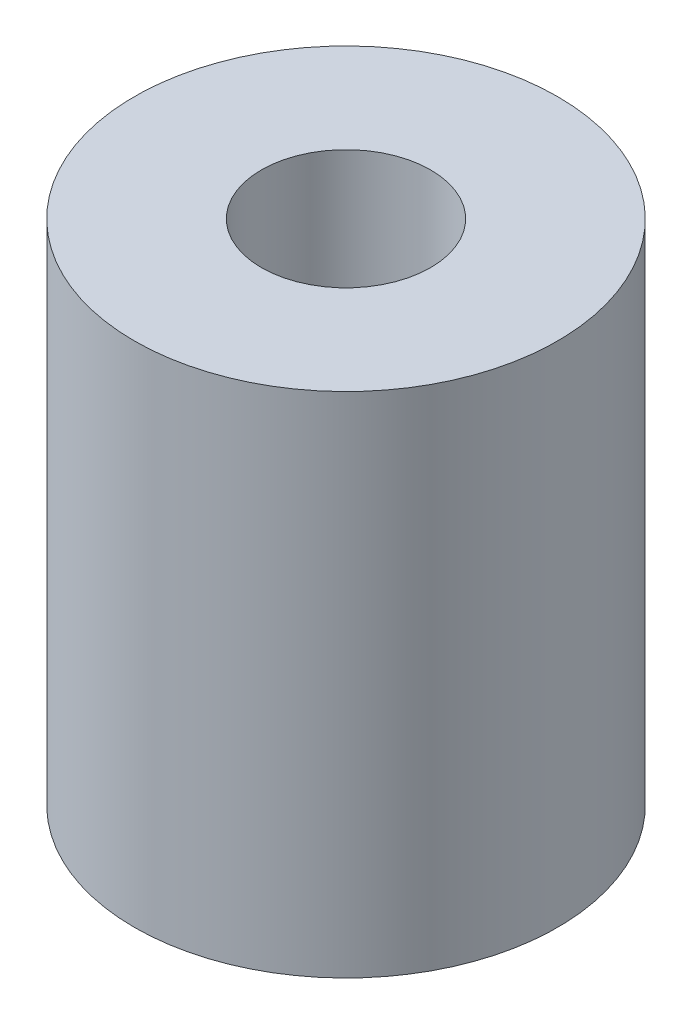
ISO-10303-21;
HEADER;
FILE_DESCRIPTION(('STEP AP214'),'2;1');
FILE_NAME('part.step','',(''),(''),'','','');
FILE_SCHEMA(('AUTOMOTIVE_DESIGN { 1 0 10303 214 1 1 1 1 }'));
ENDSEC;
DATA;
#1=APPLICATION_CONTEXT('core data for automotive mechanical design processes');
#2=APPLICATION_PROTOCOL_DEFINITION('international standard','automotive_design',2000,#1);
#3=PRODUCT_CONTEXT('',#1,'mechanical');
#4=PRODUCT('Part','Part','',(#3));
#5=PRODUCT_RELATED_PRODUCT_CATEGORY('part','',(#4));
#6=PRODUCT_DEFINITION_FORMATION('','',#4);
#7=PRODUCT_DEFINITION_CONTEXT('part definition',#1,'design');
#8=PRODUCT_DEFINITION('design','',#6,#7);
#9=PRODUCT_DEFINITION_SHAPE('','',#8);
#10=(LENGTH_UNIT() NAMED_UNIT(*) SI_UNIT(.MILLI.,.METRE.));
#11=(NAMED_UNIT(*) PLANE_ANGLE_UNIT() SI_UNIT($,.RADIAN.));
#12=(NAMED_UNIT(*) SI_UNIT($,.STERADIAN.) SOLID_ANGLE_UNIT());
#13=UNCERTAINTY_MEASURE_WITH_UNIT(LENGTH_MEASURE(1.E-05),#10,'distance_accuracy_value','');
#14=(GEOMETRIC_REPRESENTATION_CONTEXT(3) GLOBAL_UNCERTAINTY_ASSIGNED_CONTEXT((#13)) GLOBAL_UNIT_ASSIGNED_CONTEXT((#10,
#11,#12)) REPRESENTATION_CONTEXT('',''));
#15=CARTESIAN_POINT('',(0.,0.,0.));
#16=DIRECTION('',(0.,0.,1.));
#17=DIRECTION('',(1.,0.,0.));
#18=AXIS2_PLACEMENT_3D('',#15,#16,#17);
#19=CARTESIAN_POINT('',(0.,6.,0.));
#20=DIRECTION('',(0.,1.,0.));
#21=DIRECTION('',(0.,0.,1.));
#22=AXIS2_PLACEMENT_3D('',#19,#20,#21);
#23=PLANE('',#22);
#24=CARTESIAN_POINT('',(0.,6.,0.));
#25=DIRECTION('',(0.,1.,0.));
#26=DIRECTION('',(0.,0.,1.));
#27=AXIS2_PLACEMENT_3D('',#24,#25,#26);
#28=CIRCLE('',#27,2.5);
#29=CARTESIAN_POINT('',(0.,6.,2.5));
#30=VERTEX_POINT('',#29);
#31=EDGE_CURVE('E10',#30,#30,#28,.T.);
#32=ORIENTED_EDGE('',*,*,#31,.T.);
#33=EDGE_LOOP('',(#32));
#34=FACE_BOUND('',#33,.T.);
#35=CARTESIAN_POINT('',(0.,6.,0.));
#36=DIRECTION('',(0.,1.,0.));
#37=DIRECTION('',(0.,0.,1.));
#38=AXIS2_PLACEMENT_3D('',#35,#36,#37);
#39=CIRCLE('',#38,1.);
#40=CARTESIAN_POINT('',(0.,6.,1.));
#41=VERTEX_POINT('',#40);
#42=EDGE_CURVE('E54',#41,#41,#39,.T.);
#43=ORIENTED_EDGE('',*,*,#42,.F.);
#44=EDGE_LOOP('',(#43));
#45=FACE_BOUND('',#44,.T.);
#46=ADVANCED_FACE('F41',(#34,#45),#23,.T.);
#47=CARTESIAN_POINT('',(0.,0.,0.));
#48=DIRECTION('',(0.,1.,0.));
#49=DIRECTION('',(0.,0.,1.));
#50=AXIS2_PLACEMENT_3D('',#47,#48,#49);
#51=PLANE('',#50);
#52=CARTESIAN_POINT('',(0.,0.,0.));
#53=DIRECTION('',(0.,1.,0.));
#54=DIRECTION('',(0.,0.,1.));
#55=AXIS2_PLACEMENT_3D('',#52,#53,#54);
#56=CIRCLE('',#55,2.5);
#57=CARTESIAN_POINT('',(0.,0.,2.5));
#58=VERTEX_POINT('',#57);
#59=EDGE_CURVE('E45',#58,#58,#56,.T.);
#60=ORIENTED_EDGE('',*,*,#59,.F.);
#61=EDGE_LOOP('',(#60));
#62=FACE_BOUND('',#61,.T.);
#63=CARTESIAN_POINT('',(0.,0.,0.));
#64=DIRECTION('',(0.,1.,0.));
#65=DIRECTION('',(0.,0.,1.));
#66=AXIS2_PLACEMENT_3D('',#63,#64,#65);
#67=CIRCLE('',#66,1.);
#68=CARTESIAN_POINT('',(0.,0.,1.));
#69=VERTEX_POINT('',#68);
#70=EDGE_CURVE('E56',#69,#69,#67,.T.);
#71=ORIENTED_EDGE('',*,*,#70,.T.);
#72=EDGE_LOOP('',(#71));
#73=FACE_BOUND('',#72,.T.);
#74=ADVANCED_FACE('F68',(#62,#73),#51,.F.);
#75=CARTESIAN_POINT('',(0.,6.,0.));
#76=DIRECTION('',(0.,-1.,0.));
#77=DIRECTION('',(0.,0.,-1.));
#78=AXIS2_PLACEMENT_3D('',#75,#76,#77);
#79=CYLINDRICAL_SURFACE('',#78,2.5);
#80=ORIENTED_EDGE('',*,*,#31,.F.);
#81=EDGE_LOOP('',(#80));
#82=FACE_BOUND('',#81,.T.);
#83=ORIENTED_EDGE('',*,*,#59,.T.);
#84=EDGE_LOOP('',(#83));
#85=FACE_BOUND('',#84,.T.);
#86=ADVANCED_FACE('F43',(#82,#85),#79,.T.);
#87=CARTESIAN_POINT('',(0.,6.,0.));
#88=DIRECTION('',(0.,-1.,0.));
#89=DIRECTION('',(0.,0.,-1.));
#90=AXIS2_PLACEMENT_3D('',#87,#88,#89);
#91=CYLINDRICAL_SURFACE('',#90,1.);
#92=ORIENTED_EDGE('',*,*,#42,.T.);
#93=EDGE_LOOP('',(#92));
#94=FACE_BOUND('',#93,.T.);
#95=ORIENTED_EDGE('',*,*,#70,.F.);
#96=EDGE_LOOP('',(#95));
#97=FACE_BOUND('',#96,.T.);
#98=ADVANCED_FACE('F64',(#94,#97),#91,.F.);
#99=CLOSED_SHELL('',(#46,#74,#86,#98));
#100=MANIFOLD_SOLID_BREP('B2',#99);
#101=ADVANCED_BREP_SHAPE_REPRESENTATION('',(#18,#100),#14);
#102=SHAPE_DEFINITION_REPRESENTATION(#9,#101);
ENDSEC;
END-ISO-10303-21;
